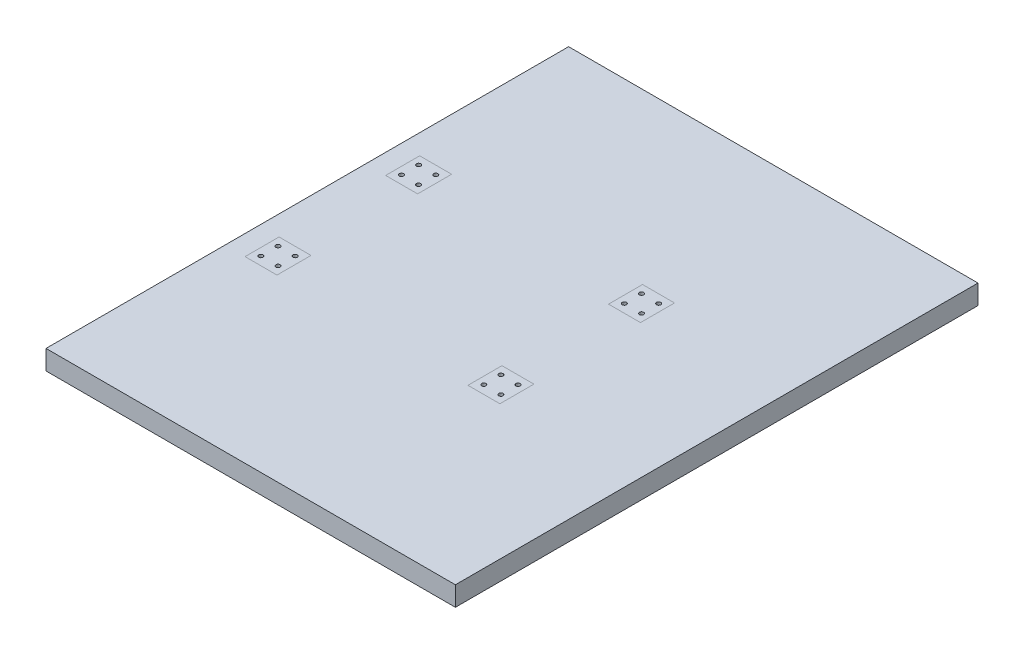
ISO-10303-21;
HEADER;
FILE_DESCRIPTION(('STEP AP214'),'2;1');
FILE_NAME('part.step','',(''),(''),'','','');
FILE_SCHEMA(('AUTOMOTIVE_DESIGN { 1 0 10303 214 1 1 1 1 }'));
ENDSEC;
DATA;
#1=APPLICATION_CONTEXT('core data for automotive mechanical design processes');
#2=APPLICATION_PROTOCOL_DEFINITION('international standard','automotive_design',2000,#1);
#3=PRODUCT_CONTEXT('',#1,'mechanical');
#4=PRODUCT('Part','Part','',(#3));
#5=PRODUCT_RELATED_PRODUCT_CATEGORY('part','',(#4));
#6=PRODUCT_DEFINITION_FORMATION('','',#4);
#7=PRODUCT_DEFINITION_CONTEXT('part definition',#1,'design');
#8=PRODUCT_DEFINITION('design','',#6,#7);
#9=PRODUCT_DEFINITION_SHAPE('','',#8);
#10=(LENGTH_UNIT() NAMED_UNIT(*) SI_UNIT(.MILLI.,.METRE.));
#11=(NAMED_UNIT(*) PLANE_ANGLE_UNIT() SI_UNIT($,.RADIAN.));
#12=(NAMED_UNIT(*) SI_UNIT($,.STERADIAN.) SOLID_ANGLE_UNIT());
#13=UNCERTAINTY_MEASURE_WITH_UNIT(LENGTH_MEASURE(1.E-05),#10,'distance_accuracy_value','');
#14=(GEOMETRIC_REPRESENTATION_CONTEXT(3) GLOBAL_UNCERTAINTY_ASSIGNED_CONTEXT((#13)) GLOBAL_UNIT_ASSIGNED_CONTEXT((#10,
#11,#12)) REPRESENTATION_CONTEXT('',''));
#15=CARTESIAN_POINT('',(0.,0.,0.));
#16=DIRECTION('',(0.,0.,1.));
#17=DIRECTION('',(1.,0.,0.));
#18=AXIS2_PLACEMENT_3D('',#15,#16,#17);
#19=CARTESIAN_POINT('',(0.,28.5,0.));
#20=DIRECTION('',(0.,1.,0.));
#21=DIRECTION('',(0.,0.,1.));
#22=AXIS2_PLACEMENT_3D('',#19,#20,#21);
#23=PLANE('',#22);
#24=DIRECTION('',(0.,0.,1.));
#25=VECTOR('',#24,1.);
#26=CARTESIAN_POINT('',(-196.099999999981,28.5,0.));
#27=LINE('',#26,#25);
#28=CARTESIAN_POINT('',(-196.099999999981,28.5,-147.300000000002));
#29=VERTEX_POINT('',#28);
#30=CARTESIAN_POINT('',(-196.099999999981,28.5,-97.7052668078004));
#31=VERTEX_POINT('',#30);
#32=EDGE_CURVE('E211',#29,#31,#27,.T.);
#33=ORIENTED_EDGE('',*,*,#32,.T.);
#34=DIRECTION('',(-1.,0.,0.));
#35=VECTOR('',#34,1.);
#36=CARTESIAN_POINT('',(0.,28.5,-97.7052668078004));
#37=LINE('',#36,#35);
#38=CARTESIAN_POINT('',(-242.699999999981,28.5,-97.7052668078004));
#39=VERTEX_POINT('',#38);
#40=EDGE_CURVE('E215',#31,#39,#37,.T.);
#41=ORIENTED_EDGE('',*,*,#40,.T.);
#42=DIRECTION('',(0.,0.,-1.));
#43=VECTOR('',#42,1.);
#44=CARTESIAN_POINT('',(-242.699999999981,28.5,0.));
#45=LINE('',#44,#43);
#46=CARTESIAN_POINT('',(-242.699999999981,28.5,-147.300000000002));
#47=VERTEX_POINT('',#46);
#48=EDGE_CURVE('E203',#39,#47,#45,.T.);
#49=ORIENTED_EDGE('',*,*,#48,.T.);
#50=DIRECTION('',(1.,0.,0.));
#51=VECTOR('',#50,1.);
#52=CARTESIAN_POINT('',(0.,28.5,-147.300000000002));
#53=LINE('',#52,#51);
#54=EDGE_CURVE('E207',#47,#29,#53,.T.);
#55=ORIENTED_EDGE('',*,*,#54,.T.);
#56=EDGE_LOOP('',(#33,#41,#49,#55));
#57=FACE_BOUND('',#56,.T.);
#58=DIRECTION('',(0.,0.,-1.));
#59=VECTOR('',#58,1.);
#60=CARTESIAN_POINT('',(-567.699999999979,28.5,1.39793265849579E-11));
#61=LINE('',#60,#59);
#62=CARTESIAN_POINT('',(-567.699999999976,28.5,107.300000000007));
#63=VERTEX_POINT('',#62);
#64=CARTESIAN_POINT('',(-567.699999999977,28.5,57.7052668078051));
#65=VERTEX_POINT('',#64);
#66=EDGE_CURVE('E181',#63,#65,#61,.T.);
#67=ORIENTED_EDGE('',*,*,#66,.T.);
#68=DIRECTION('',(1.,0.,0.));
#69=VECTOR('',#68,1.);
#70=CARTESIAN_POINT('',(1.40917078859337E-12,28.5,57.7052668077912));
#71=LINE('',#70,#69);
#72=CARTESIAN_POINT('',(-521.099999999977,28.5,57.705266807804));
#73=VERTEX_POINT('',#72);
#74=EDGE_CURVE('E185',#65,#73,#71,.T.);
#75=ORIENTED_EDGE('',*,*,#74,.T.);
#76=DIRECTION('',(0.,0.,1.));
#77=VECTOR('',#76,1.);
#78=CARTESIAN_POINT('',(-521.099999999979,28.5,1.28318250544681E-11));
#79=LINE('',#78,#77);
#80=CARTESIAN_POINT('',(-521.099999999976,28.5,107.300000000006));
#81=VERTEX_POINT('',#80);
#82=EDGE_CURVE('E173',#73,#81,#79,.T.);
#83=ORIENTED_EDGE('',*,*,#82,.T.);
#84=DIRECTION('',(-1.,0.,0.));
#85=VECTOR('',#84,1.);
#86=CARTESIAN_POINT('',(2.62028119754997E-12,28.5,107.299999999993));
#87=LINE('',#86,#85);
#88=EDGE_CURVE('E177',#81,#63,#87,.T.);
#89=ORIENTED_EDGE('',*,*,#88,.T.);
#90=EDGE_LOOP('',(#67,#75,#83,#89));
#91=FACE_BOUND('',#90,.T.);
#92=DIRECTION('',(0.,0.,1.));
#93=VECTOR('',#92,1.);
#94=CARTESIAN_POINT('',(0.,28.5,-393.7));
#95=LINE('',#94,#93);
#96=CARTESIAN_POINT('',(0.,28.5,-393.7));
#97=VERTEX_POINT('',#96);
#98=CARTESIAN_POINT('',(0.,28.5,368.3));
#99=VERTEX_POINT('',#98);
#100=EDGE_CURVE('E132',#97,#99,#95,.T.);
#101=ORIENTED_EDGE('',*,*,#100,.F.);
#102=DIRECTION('',(-1.,0.,0.));
#103=VECTOR('',#102,1.);
#104=CARTESIAN_POINT('',(-596.9,28.5,-393.7));
#105=LINE('',#104,#103);
#106=CARTESIAN_POINT('',(-596.9,28.5,-393.7));
#107=VERTEX_POINT('',#106);
#108=EDGE_CURVE('E161',#97,#107,#105,.T.);
#109=ORIENTED_EDGE('',*,*,#108,.T.);
#110=DIRECTION('',(0.,0.,1.));
#111=VECTOR('',#110,1.);
#112=CARTESIAN_POINT('',(-596.9,28.5,-393.7));
#113=LINE('',#112,#111);
#114=CARTESIAN_POINT('',(-596.9,28.5,368.3));
#115=VERTEX_POINT('',#114);
#116=EDGE_CURVE('E155',#107,#115,#113,.T.);
#117=ORIENTED_EDGE('',*,*,#116,.T.);
#118=DIRECTION('',(1.,0.,0.));
#119=VECTOR('',#118,1.);
#120=CARTESIAN_POINT('',(-596.9,28.5,368.3));
#121=LINE('',#120,#119);
#122=EDGE_CURVE('E149',#115,#99,#121,.T.);
#123=ORIENTED_EDGE('',*,*,#122,.T.);
#124=EDGE_LOOP('',(#101,#109,#117,#123));
#125=FACE_BOUND('',#124,.T.);
#126=DIRECTION('',(0.,0.,-1.));
#127=VECTOR('',#126,1.);
#128=CARTESIAN_POINT('',(-242.699999999978,28.5,5.97636526716419E-12));
#129=LINE('',#128,#127);
#130=CARTESIAN_POINT('',(-242.699999999975,28.5,107.299999999999));
#131=VERTEX_POINT('',#130);
#132=CARTESIAN_POINT('',(-242.699999999977,28.5,57.7052668077973));
#133=VERTEX_POINT('',#132);
#134=EDGE_CURVE('E196',#131,#133,#129,.T.);
#135=ORIENTED_EDGE('',*,*,#134,.T.);
#136=DIRECTION('',(1.,0.,0.));
#137=VECTOR('',#136,1.);
#138=CARTESIAN_POINT('',(1.40917078859338E-12,28.5,57.7052668077914));
#139=LINE('',#138,#137);
#140=CARTESIAN_POINT('',(-196.099999999977,28.5,57.7052668077962));
#141=VERTEX_POINT('',#140);
#142=EDGE_CURVE('E200',#133,#141,#139,.T.);
#143=ORIENTED_EDGE('',*,*,#142,.T.);
#144=DIRECTION('',(0.,0.,1.));
#145=VECTOR('',#144,1.);
#146=CARTESIAN_POINT('',(-196.099999999978,28.5,4.82886373667438E-12));
#147=LINE('',#146,#145);
#148=CARTESIAN_POINT('',(-196.099999999975,28.5,107.299999999998));
#149=VERTEX_POINT('',#148);
#150=EDGE_CURVE('E188',#141,#149,#147,.T.);
#151=ORIENTED_EDGE('',*,*,#150,.T.);
#152=DIRECTION('',(-1.,0.,0.));
#153=VECTOR('',#152,1.);
#154=CARTESIAN_POINT('',(2.62028119754998E-12,28.5,107.299999999993));
#155=LINE('',#154,#153);
#156=EDGE_CURVE('E192',#149,#131,#155,.T.);
#157=ORIENTED_EDGE('',*,*,#156,.T.);
#158=EDGE_LOOP('',(#135,#143,#151,#157));
#159=FACE_BOUND('',#158,.T.);
#160=DIRECTION('',(0.,0.,1.));
#161=VECTOR('',#160,1.);
#162=CARTESIAN_POINT('',(-521.099999999982,28.5,0.));
#163=LINE('',#162,#161);
#164=CARTESIAN_POINT('',(-521.099999999982,28.5,-147.299999999995));
#165=VERTEX_POINT('',#164);
#166=CARTESIAN_POINT('',(-521.099999999982,28.5,-97.7052668077925));
#167=VERTEX_POINT('',#166);
#168=EDGE_CURVE('E57',#165,#167,#163,.T.);
#169=ORIENTED_EDGE('',*,*,#168,.T.);
#170=DIRECTION('',(-1.,0.,0.));
#171=VECTOR('',#170,1.);
#172=CARTESIAN_POINT('',(0.,28.5,-97.7052668077925));
#173=LINE('',#172,#171);
#174=CARTESIAN_POINT('',(-567.699999999982,28.5,-97.7052668077925));
#175=VERTEX_POINT('',#174);
#176=EDGE_CURVE('E12',#167,#175,#173,.T.);
#177=ORIENTED_EDGE('',*,*,#176,.T.);
#178=DIRECTION('',(0.,0.,-1.));
#179=VECTOR('',#178,1.);
#180=CARTESIAN_POINT('',(-567.699999999982,28.5,0.));
#181=LINE('',#180,#179);
#182=CARTESIAN_POINT('',(-567.699999999982,28.5,-147.299999999995));
#183=VERTEX_POINT('',#182);
#184=EDGE_CURVE('E218',#175,#183,#181,.T.);
#185=ORIENTED_EDGE('',*,*,#184,.T.);
#186=DIRECTION('',(1.,0.,0.));
#187=VECTOR('',#186,1.);
#188=CARTESIAN_POINT('',(0.,28.5,-147.299999999995));
#189=LINE('',#188,#187);
#190=EDGE_CURVE('E222',#183,#165,#189,.T.);
#191=ORIENTED_EDGE('',*,*,#190,.T.);
#192=EDGE_LOOP('',(#169,#177,#185,#191));
#193=FACE_BOUND('',#192,.T.);
#194=ADVANCED_FACE('F48',(#57,#91,#125,#159,#193),#23,.T.);
#195=ORIENTED_EDGE('',*,*,#176,.F.);
#196=ORIENTED_EDGE('',*,*,#168,.F.);
#197=ORIENTED_EDGE('',*,*,#190,.F.);
#198=ORIENTED_EDGE('',*,*,#184,.F.);
#199=EDGE_LOOP('',(#195,#196,#197,#198));
#200=FACE_BOUND('',#199,.T.);
#201=CARTESIAN_POINT('',(-556.9,28.5,-135.));
#202=DIRECTION('',(0.,1.,0.));
#203=DIRECTION('',(0.,0.,1.));
#204=AXIS2_PLACEMENT_3D('',#201,#202,#203);
#205=CIRCLE('',#204,3.09999999999999);
#206=CARTESIAN_POINT('',(-556.9,28.5,-131.9));
#207=VERTEX_POINT('',#206);
#208=EDGE_CURVE('E236',#207,#207,#205,.T.);
#209=ORIENTED_EDGE('',*,*,#208,.F.);
#210=EDGE_LOOP('',(#209));
#211=FACE_BOUND('',#210,.T.);
#212=CARTESIAN_POINT('',(-531.9,28.5,-135.));
#213=DIRECTION('',(0.,1.,0.));
#214=DIRECTION('',(0.,0.,1.));
#215=AXIS2_PLACEMENT_3D('',#212,#213,#214);
#216=CIRCLE('',#215,3.09999999999999);
#217=CARTESIAN_POINT('',(-531.9,28.5,-131.9));
#218=VERTEX_POINT('',#217);
#219=EDGE_CURVE('E240',#218,#218,#216,.T.);
#220=ORIENTED_EDGE('',*,*,#219,.F.);
#221=EDGE_LOOP('',(#220));
#222=FACE_BOUND('',#221,.T.);
#223=CARTESIAN_POINT('',(-531.9,28.5,-110.));
#224=DIRECTION('',(0.,1.,0.));
#225=DIRECTION('',(0.,0.,1.));
#226=AXIS2_PLACEMENT_3D('',#223,#224,#225);
#227=CIRCLE('',#226,3.09999999999999);
#228=CARTESIAN_POINT('',(-531.9,28.5,-106.9));
#229=VERTEX_POINT('',#228);
#230=EDGE_CURVE('E244',#229,#229,#227,.T.);
#231=ORIENTED_EDGE('',*,*,#230,.F.);
#232=EDGE_LOOP('',(#231));
#233=FACE_BOUND('',#232,.T.);
#234=CARTESIAN_POINT('',(-556.9,28.5,-110.));
#235=DIRECTION('',(0.,1.,0.));
#236=DIRECTION('',(0.,0.,1.));
#237=AXIS2_PLACEMENT_3D('',#234,#235,#236);
#238=CIRCLE('',#237,3.09999999999999);
#239=CARTESIAN_POINT('',(-556.9,28.5,-106.9));
#240=VERTEX_POINT('',#239);
#241=EDGE_CURVE('E247',#240,#240,#238,.T.);
#242=ORIENTED_EDGE('',*,*,#241,.F.);
#243=EDGE_LOOP('',(#242));
#244=FACE_BOUND('',#243,.T.);
#245=ADVANCED_FACE('F228',(#200,#211,#222,#233,#244),#23,.T.);
#246=ORIENTED_EDGE('',*,*,#40,.F.);
#247=ORIENTED_EDGE('',*,*,#32,.F.);
#248=ORIENTED_EDGE('',*,*,#54,.F.);
#249=ORIENTED_EDGE('',*,*,#48,.F.);
#250=EDGE_LOOP('',(#246,#247,#248,#249));
#251=FACE_BOUND('',#250,.T.);
#252=CARTESIAN_POINT('',(-231.9,28.5,-110.));
#253=DIRECTION('',(0.,1.,0.));
#254=DIRECTION('',(0.,0.,1.));
#255=AXIS2_PLACEMENT_3D('',#252,#253,#254);
#256=CIRCLE('',#255,3.09999999999999);
#257=CARTESIAN_POINT('',(-231.9,28.5,-106.9));
#258=VERTEX_POINT('',#257);
#259=EDGE_CURVE('E259',#258,#258,#256,.T.);
#260=ORIENTED_EDGE('',*,*,#259,.F.);
#261=EDGE_LOOP('',(#260));
#262=FACE_BOUND('',#261,.T.);
#263=CARTESIAN_POINT('',(-206.9,28.5,-110.));
#264=DIRECTION('',(0.,1.,0.));
#265=DIRECTION('',(0.,0.,1.));
#266=AXIS2_PLACEMENT_3D('',#263,#264,#265);
#267=CIRCLE('',#266,3.09999999999999);
#268=CARTESIAN_POINT('',(-206.9,28.5,-106.9));
#269=VERTEX_POINT('',#268);
#270=EDGE_CURVE('E277',#269,#269,#267,.T.);
#271=ORIENTED_EDGE('',*,*,#270,.F.);
#272=EDGE_LOOP('',(#271));
#273=FACE_BOUND('',#272,.T.);
#274=CARTESIAN_POINT('',(-206.9,28.5,-135.));
#275=DIRECTION('',(0.,1.,0.));
#276=DIRECTION('',(0.,0.,1.));
#277=AXIS2_PLACEMENT_3D('',#274,#275,#276);
#278=CIRCLE('',#277,3.09999999999999);
#279=CARTESIAN_POINT('',(-206.9,28.5,-131.9));
#280=VERTEX_POINT('',#279);
#281=EDGE_CURVE('E282',#280,#280,#278,.T.);
#282=ORIENTED_EDGE('',*,*,#281,.F.);
#283=EDGE_LOOP('',(#282));
#284=FACE_BOUND('',#283,.T.);
#285=CARTESIAN_POINT('',(-231.9,28.5,-135.));
#286=DIRECTION('',(0.,1.,0.));
#287=DIRECTION('',(0.,0.,1.));
#288=AXIS2_PLACEMENT_3D('',#285,#286,#287);
#289=CIRCLE('',#288,3.09999999999999);
#290=CARTESIAN_POINT('',(-231.9,28.5,-131.9));
#291=VERTEX_POINT('',#290);
#292=EDGE_CURVE('E288',#291,#291,#289,.T.);
#293=ORIENTED_EDGE('',*,*,#292,.F.);
#294=EDGE_LOOP('',(#293));
#295=FACE_BOUND('',#294,.T.);
#296=ADVANCED_FACE('F231',(#251,#262,#273,#284,#295),#23,.T.);
#297=ORIENTED_EDGE('',*,*,#142,.F.);
#298=ORIENTED_EDGE('',*,*,#134,.F.);
#299=ORIENTED_EDGE('',*,*,#156,.F.);
#300=ORIENTED_EDGE('',*,*,#150,.F.);
#301=EDGE_LOOP('',(#297,#298,#299,#300));
#302=FACE_BOUND('',#301,.T.);
#303=CARTESIAN_POINT('',(-206.9,28.5,94.9999999999999));
#304=DIRECTION('',(0.,1.,0.));
#305=DIRECTION('',(0.,0.,-1.));
#306=AXIS2_PLACEMENT_3D('',#303,#304,#305);
#307=CIRCLE('',#306,3.09999999999999);
#308=CARTESIAN_POINT('',(-206.9,28.5,91.8999999999999));
#309=VERTEX_POINT('',#308);
#310=EDGE_CURVE('E306',#309,#309,#307,.T.);
#311=ORIENTED_EDGE('',*,*,#310,.F.);
#312=EDGE_LOOP('',(#311));
#313=FACE_BOUND('',#312,.T.);
#314=CARTESIAN_POINT('',(-231.9,28.5,94.9999999999999));
#315=DIRECTION('',(0.,1.,0.));
#316=DIRECTION('',(0.,0.,-1.));
#317=AXIS2_PLACEMENT_3D('',#314,#315,#316);
#318=CIRCLE('',#317,3.09999999999999);
#319=CARTESIAN_POINT('',(-231.9,28.5,91.8999999999999));
#320=VERTEX_POINT('',#319);
#321=EDGE_CURVE('E300',#320,#320,#318,.T.);
#322=ORIENTED_EDGE('',*,*,#321,.F.);
#323=EDGE_LOOP('',(#322));
#324=FACE_BOUND('',#323,.T.);
#325=CARTESIAN_POINT('',(-231.9,28.5,70.));
#326=DIRECTION('',(0.,1.,0.));
#327=DIRECTION('',(0.,0.,-1.));
#328=AXIS2_PLACEMENT_3D('',#325,#326,#327);
#329=CIRCLE('',#328,3.09999999999999);
#330=CARTESIAN_POINT('',(-231.9,28.5,66.9));
#331=VERTEX_POINT('',#330);
#332=EDGE_CURVE('E294',#331,#331,#329,.T.);
#333=ORIENTED_EDGE('',*,*,#332,.F.);
#334=EDGE_LOOP('',(#333));
#335=FACE_BOUND('',#334,.T.);
#336=CARTESIAN_POINT('',(-206.9,28.5,70.));
#337=DIRECTION('',(0.,1.,0.));
#338=DIRECTION('',(0.,0.,-1.));
#339=AXIS2_PLACEMENT_3D('',#336,#337,#338);
#340=CIRCLE('',#339,3.09999999999999);
#341=CARTESIAN_POINT('',(-206.9,28.5,66.9));
#342=VERTEX_POINT('',#341);
#343=EDGE_CURVE('E249',#342,#342,#340,.T.);
#344=ORIENTED_EDGE('',*,*,#343,.F.);
#345=EDGE_LOOP('',(#344));
#346=FACE_BOUND('',#345,.T.);
#347=ADVANCED_FACE('F361',(#302,#313,#324,#335,#346),#23,.T.);
#348=CARTESIAN_POINT('',(-596.9,28.5,-393.7));
#349=DIRECTION('',(0.,0.,1.));
#350=DIRECTION('',(1.,0.,0.));
#351=AXIS2_PLACEMENT_3D('',#348,#349,#350);
#352=PLANE('',#351);
#353=ORIENTED_EDGE('',*,*,#108,.F.);
#354=DIRECTION('',(0.,-1.,0.));
#355=VECTOR('',#354,1.);
#356=CARTESIAN_POINT('',(0.,0.,-393.7));
#357=LINE('',#356,#355);
#358=CARTESIAN_POINT('',(0.,0.,-393.7));
#359=VERTEX_POINT('',#358);
#360=EDGE_CURVE('E138',#97,#359,#357,.T.);
#361=ORIENTED_EDGE('',*,*,#360,.T.);
#362=DIRECTION('',(-1.,0.,0.));
#363=VECTOR('',#362,1.);
#364=CARTESIAN_POINT('',(-596.9,0.,-393.7));
#365=LINE('',#364,#363);
#366=CARTESIAN_POINT('',(-596.9,0.,-393.7));
#367=VERTEX_POINT('',#366);
#368=EDGE_CURVE('E165',#359,#367,#365,.T.);
#369=ORIENTED_EDGE('',*,*,#368,.T.);
#370=DIRECTION('',(0.,-1.,0.));
#371=VECTOR('',#370,1.);
#372=CARTESIAN_POINT('',(-596.9,28.5,-393.7));
#373=LINE('',#372,#371);
#374=EDGE_CURVE('E159',#107,#367,#373,.T.);
#375=ORIENTED_EDGE('',*,*,#374,.F.);
#376=EDGE_LOOP('',(#353,#361,#369,#375));
#377=FACE_BOUND('',#376,.T.);
#378=ADVANCED_FACE('F50',(#377),#352,.F.);
#379=CARTESIAN_POINT('',(-596.9,28.5,-393.7));
#380=DIRECTION('',(1.,0.,0.));
#381=DIRECTION('',(0.,0.,-1.));
#382=AXIS2_PLACEMENT_3D('',#379,#380,#381);
#383=PLANE('',#382);
#384=DIRECTION('',(0.,0.,1.));
#385=VECTOR('',#384,1.);
#386=CARTESIAN_POINT('',(-596.9,0.,-393.7));
#387=LINE('',#386,#385);
#388=CARTESIAN_POINT('',(-596.9,0.,368.3));
#389=VERTEX_POINT('',#388);
#390=EDGE_CURVE('E167',#367,#389,#387,.T.);
#391=ORIENTED_EDGE('',*,*,#390,.T.);
#392=DIRECTION('',(0.,-1.,0.));
#393=VECTOR('',#392,1.);
#394=CARTESIAN_POINT('',(-596.9,28.5,368.3));
#395=LINE('',#394,#393);
#396=EDGE_CURVE('E157',#115,#389,#395,.T.);
#397=ORIENTED_EDGE('',*,*,#396,.F.);
#398=ORIENTED_EDGE('',*,*,#116,.F.);
#399=ORIENTED_EDGE('',*,*,#374,.T.);
#400=EDGE_LOOP('',(#391,#397,#398,#399));
#401=FACE_BOUND('',#400,.T.);
#402=ADVANCED_FACE('F342',(#401),#383,.F.);
#403=CARTESIAN_POINT('',(-596.9,28.5,368.3));
#404=DIRECTION('',(0.,0.,-1.));
#405=DIRECTION('',(-1.,0.,0.));
#406=AXIS2_PLACEMENT_3D('',#403,#404,#405);
#407=PLANE('',#406);
#408=DIRECTION('',(1.,0.,0.));
#409=VECTOR('',#408,1.);
#410=CARTESIAN_POINT('',(-596.9,0.,368.3));
#411=LINE('',#410,#409);
#412=CARTESIAN_POINT('',(0.,0.,368.3));
#413=VERTEX_POINT('',#412);
#414=EDGE_CURVE('E151',#389,#413,#411,.T.);
#415=ORIENTED_EDGE('',*,*,#414,.T.);
#416=DIRECTION('',(0.,-1.,0.));
#417=VECTOR('',#416,1.);
#418=CARTESIAN_POINT('',(0.,0.,368.3));
#419=LINE('',#418,#417);
#420=EDGE_CURVE('E135',#99,#413,#419,.T.);
#421=ORIENTED_EDGE('',*,*,#420,.F.);
#422=ORIENTED_EDGE('',*,*,#122,.F.);
#423=ORIENTED_EDGE('',*,*,#396,.T.);
#424=EDGE_LOOP('',(#415,#421,#422,#423));
#425=FACE_BOUND('',#424,.T.);
#426=ADVANCED_FACE('F147',(#425),#407,.F.);
#427=ORIENTED_EDGE('',*,*,#74,.F.);
#428=ORIENTED_EDGE('',*,*,#66,.F.);
#429=ORIENTED_EDGE('',*,*,#88,.F.);
#430=ORIENTED_EDGE('',*,*,#82,.F.);
#431=EDGE_LOOP('',(#427,#428,#429,#430));
#432=FACE_BOUND('',#431,.T.);
#433=CARTESIAN_POINT('',(-531.9,28.5,70.));
#434=DIRECTION('',(0.,1.,0.));
#435=DIRECTION('',(0.,0.,-1.));
#436=AXIS2_PLACEMENT_3D('',#433,#434,#435);
#437=CIRCLE('',#436,3.09999999999999);
#438=CARTESIAN_POINT('',(-531.9,28.5,66.9));
#439=VERTEX_POINT('',#438);
#440=EDGE_CURVE('E312',#439,#439,#437,.T.);
#441=ORIENTED_EDGE('',*,*,#440,.F.);
#442=EDGE_LOOP('',(#441));
#443=FACE_BOUND('',#442,.T.);
#444=CARTESIAN_POINT('',(-531.9,28.5,94.9999999999999));
#445=DIRECTION('',(0.,1.,0.));
#446=DIRECTION('',(0.,0.,-1.));
#447=AXIS2_PLACEMENT_3D('',#444,#445,#446);
#448=CIRCLE('',#447,3.09999999999999);
#449=CARTESIAN_POINT('',(-531.9,28.5,91.8999999999999));
#450=VERTEX_POINT('',#449);
#451=EDGE_CURVE('E318',#450,#450,#448,.T.);
#452=ORIENTED_EDGE('',*,*,#451,.F.);
#453=EDGE_LOOP('',(#452));
#454=FACE_BOUND('',#453,.T.);
#455=CARTESIAN_POINT('',(-556.9,28.5,70.));
#456=DIRECTION('',(0.,1.,0.));
#457=DIRECTION('',(0.,0.,-1.));
#458=AXIS2_PLACEMENT_3D('',#455,#456,#457);
#459=CIRCLE('',#458,3.09999999999999);
#460=CARTESIAN_POINT('',(-556.9,28.5,66.9));
#461=VERTEX_POINT('',#460);
#462=EDGE_CURVE('E324',#461,#461,#459,.T.);
#463=ORIENTED_EDGE('',*,*,#462,.F.);
#464=EDGE_LOOP('',(#463));
#465=FACE_BOUND('',#464,.T.);
#466=CARTESIAN_POINT('',(-556.9,28.5,94.9999999999999));
#467=DIRECTION('',(0.,1.,0.));
#468=DIRECTION('',(0.,0.,-1.));
#469=AXIS2_PLACEMENT_3D('',#466,#467,#468);
#470=CIRCLE('',#469,3.09999999999999);
#471=CARTESIAN_POINT('',(-556.9,28.5,91.8999999999999));
#472=VERTEX_POINT('',#471);
#473=EDGE_CURVE('E330',#472,#472,#470,.T.);
#474=ORIENTED_EDGE('',*,*,#473,.F.);
#475=EDGE_LOOP('',(#474));
#476=FACE_BOUND('',#475,.T.);
#477=ADVANCED_FACE('F348',(#432,#443,#454,#465,#476),#23,.T.);
#478=CARTESIAN_POINT('',(0.,0.,0.));
#479=DIRECTION('',(0.,1.,0.));
#480=DIRECTION('',(0.,0.,1.));
#481=AXIS2_PLACEMENT_3D('',#478,#479,#480);
#482=PLANE('',#481);
#483=CARTESIAN_POINT('',(-556.9,0.,-110.));
#484=DIRECTION('',(0.,1.,0.));
#485=DIRECTION('',(0.,0.,1.));
#486=AXIS2_PLACEMENT_3D('',#483,#484,#485);
#487=CIRCLE('',#486,3.09999999999999);
#488=CARTESIAN_POINT('',(-556.9,0.,-106.9));
#489=VERTEX_POINT('',#488);
#490=EDGE_CURVE('E168',#489,#489,#487,.F.);
#491=ORIENTED_EDGE('',*,*,#490,.F.);
#492=EDGE_LOOP('',(#491));
#493=FACE_BOUND('',#492,.T.);
#494=CARTESIAN_POINT('',(-206.9,0.,70.));
#495=DIRECTION('',(0.,1.,0.));
#496=DIRECTION('',(0.,0.,1.));
#497=AXIS2_PLACEMENT_3D('',#494,#495,#496);
#498=CIRCLE('',#497,3.09999999999999);
#499=CARTESIAN_POINT('',(-206.9,0.,73.0999999999999));
#500=VERTEX_POINT('',#499);
#501=EDGE_CURVE('E254',#500,#500,#498,.F.);
#502=ORIENTED_EDGE('',*,*,#501,.F.);
#503=EDGE_LOOP('',(#502));
#504=FACE_BOUND('',#503,.T.);
#505=CARTESIAN_POINT('',(-231.9,0.,-110.));
#506=DIRECTION('',(0.,1.,0.));
#507=DIRECTION('',(0.,0.,1.));
#508=AXIS2_PLACEMENT_3D('',#505,#506,#507);
#509=CIRCLE('',#508,3.09999999999999);
#510=CARTESIAN_POINT('',(-231.9,0.,-106.9));
#511=VERTEX_POINT('',#510);
#512=EDGE_CURVE('E261',#511,#511,#509,.F.);
#513=ORIENTED_EDGE('',*,*,#512,.F.);
#514=EDGE_LOOP('',(#513));
#515=FACE_BOUND('',#514,.T.);
#516=CARTESIAN_POINT('',(-531.9,0.,-110.));
#517=DIRECTION('',(0.,1.,0.));
#518=DIRECTION('',(0.,0.,1.));
#519=AXIS2_PLACEMENT_3D('',#516,#517,#518);
#520=CIRCLE('',#519,3.09999999999999);
#521=CARTESIAN_POINT('',(-531.9,0.,-106.9));
#522=VERTEX_POINT('',#521);
#523=EDGE_CURVE('E266',#522,#522,#520,.F.);
#524=ORIENTED_EDGE('',*,*,#523,.F.);
#525=EDGE_LOOP('',(#524));
#526=FACE_BOUND('',#525,.T.);
#527=CARTESIAN_POINT('',(-531.9,0.,-135.));
#528=DIRECTION('',(0.,1.,0.));
#529=DIRECTION('',(0.,0.,1.));
#530=AXIS2_PLACEMENT_3D('',#527,#528,#529);
#531=CIRCLE('',#530,3.09999999999999);
#532=CARTESIAN_POINT('',(-531.9,0.,-131.9));
#533=VERTEX_POINT('',#532);
#534=EDGE_CURVE('E270',#533,#533,#531,.F.);
#535=ORIENTED_EDGE('',*,*,#534,.F.);
#536=EDGE_LOOP('',(#535));
#537=FACE_BOUND('',#536,.T.);
#538=CARTESIAN_POINT('',(-556.9,0.,-135.));
#539=DIRECTION('',(0.,1.,0.));
#540=DIRECTION('',(0.,0.,1.));
#541=AXIS2_PLACEMENT_3D('',#538,#539,#540);
#542=CIRCLE('',#541,3.09999999999999);
#543=CARTESIAN_POINT('',(-556.9,0.,-131.9));
#544=VERTEX_POINT('',#543);
#545=EDGE_CURVE('E274',#544,#544,#542,.F.);
#546=ORIENTED_EDGE('',*,*,#545,.F.);
#547=EDGE_LOOP('',(#546));
#548=FACE_BOUND('',#547,.T.);
#549=CARTESIAN_POINT('',(-206.9,0.,-110.));
#550=DIRECTION('',(0.,1.,0.));
#551=DIRECTION('',(0.,0.,1.));
#552=AXIS2_PLACEMENT_3D('',#549,#550,#551);
#553=CIRCLE('',#552,3.09999999999999);
#554=CARTESIAN_POINT('',(-206.9,0.,-106.9));
#555=VERTEX_POINT('',#554);
#556=EDGE_CURVE('E279',#555,#555,#553,.F.);
#557=ORIENTED_EDGE('',*,*,#556,.F.);
#558=EDGE_LOOP('',(#557));
#559=FACE_BOUND('',#558,.T.);
#560=CARTESIAN_POINT('',(-206.9,0.,-135.));
#561=DIRECTION('',(0.,1.,0.));
#562=DIRECTION('',(0.,0.,1.));
#563=AXIS2_PLACEMENT_3D('',#560,#561,#562);
#564=CIRCLE('',#563,3.09999999999999);
#565=CARTESIAN_POINT('',(-206.9,0.,-131.9));
#566=VERTEX_POINT('',#565);
#567=EDGE_CURVE('E285',#566,#566,#564,.F.);
#568=ORIENTED_EDGE('',*,*,#567,.F.);
#569=EDGE_LOOP('',(#568));
#570=FACE_BOUND('',#569,.T.);
#571=CARTESIAN_POINT('',(-231.9,0.,-135.));
#572=DIRECTION('',(0.,1.,0.));
#573=DIRECTION('',(0.,0.,1.));
#574=AXIS2_PLACEMENT_3D('',#571,#572,#573);
#575=CIRCLE('',#574,3.09999999999999);
#576=CARTESIAN_POINT('',(-231.9,0.,-131.9));
#577=VERTEX_POINT('',#576);
#578=EDGE_CURVE('E291',#577,#577,#575,.F.);
#579=ORIENTED_EDGE('',*,*,#578,.F.);
#580=EDGE_LOOP('',(#579));
#581=FACE_BOUND('',#580,.T.);
#582=CARTESIAN_POINT('',(-231.9,0.,70.));
#583=DIRECTION('',(0.,1.,0.));
#584=DIRECTION('',(0.,0.,1.));
#585=AXIS2_PLACEMENT_3D('',#582,#583,#584);
#586=CIRCLE('',#585,3.09999999999999);
#587=CARTESIAN_POINT('',(-231.9,0.,73.0999999999999));
#588=VERTEX_POINT('',#587);
#589=EDGE_CURVE('E297',#588,#588,#586,.F.);
#590=ORIENTED_EDGE('',*,*,#589,.F.);
#591=EDGE_LOOP('',(#590));
#592=FACE_BOUND('',#591,.T.);
#593=CARTESIAN_POINT('',(-231.9,0.,94.9999999999999));
#594=DIRECTION('',(0.,1.,0.));
#595=DIRECTION('',(0.,0.,1.));
#596=AXIS2_PLACEMENT_3D('',#593,#594,#595);
#597=CIRCLE('',#596,3.09999999999999);
#598=CARTESIAN_POINT('',(-231.9,0.,98.0999999999999));
#599=VERTEX_POINT('',#598);
#600=EDGE_CURVE('E303',#599,#599,#597,.F.);
#601=ORIENTED_EDGE('',*,*,#600,.F.);
#602=EDGE_LOOP('',(#601));
#603=FACE_BOUND('',#602,.T.);
#604=CARTESIAN_POINT('',(-206.9,0.,94.9999999999999));
#605=DIRECTION('',(0.,1.,0.));
#606=DIRECTION('',(0.,0.,1.));
#607=AXIS2_PLACEMENT_3D('',#604,#605,#606);
#608=CIRCLE('',#607,3.09999999999999);
#609=CARTESIAN_POINT('',(-206.9,0.,98.0999999999999));
#610=VERTEX_POINT('',#609);
#611=EDGE_CURVE('E309',#610,#610,#608,.F.);
#612=ORIENTED_EDGE('',*,*,#611,.F.);
#613=EDGE_LOOP('',(#612));
#614=FACE_BOUND('',#613,.T.);
#615=CARTESIAN_POINT('',(-531.9,0.,70.));
#616=DIRECTION('',(0.,1.,0.));
#617=DIRECTION('',(0.,0.,1.));
#618=AXIS2_PLACEMENT_3D('',#615,#616,#617);
#619=CIRCLE('',#618,3.09999999999999);
#620=CARTESIAN_POINT('',(-531.9,0.,73.0999999999999));
#621=VERTEX_POINT('',#620);
#622=EDGE_CURVE('E315',#621,#621,#619,.F.);
#623=ORIENTED_EDGE('',*,*,#622,.F.);
#624=EDGE_LOOP('',(#623));
#625=FACE_BOUND('',#624,.T.);
#626=CARTESIAN_POINT('',(-531.9,0.,94.9999999999999));
#627=DIRECTION('',(0.,1.,0.));
#628=DIRECTION('',(0.,0.,1.));
#629=AXIS2_PLACEMENT_3D('',#626,#627,#628);
#630=CIRCLE('',#629,3.09999999999999);
#631=CARTESIAN_POINT('',(-531.9,0.,98.0999999999999));
#632=VERTEX_POINT('',#631);
#633=EDGE_CURVE('E321',#632,#632,#630,.F.);
#634=ORIENTED_EDGE('',*,*,#633,.F.);
#635=EDGE_LOOP('',(#634));
#636=FACE_BOUND('',#635,.T.);
#637=CARTESIAN_POINT('',(-556.9,0.,70.));
#638=DIRECTION('',(0.,1.,0.));
#639=DIRECTION('',(0.,0.,1.));
#640=AXIS2_PLACEMENT_3D('',#637,#638,#639);
#641=CIRCLE('',#640,3.09999999999999);
#642=CARTESIAN_POINT('',(-556.9,0.,73.0999999999999));
#643=VERTEX_POINT('',#642);
#644=EDGE_CURVE('E327',#643,#643,#641,.F.);
#645=ORIENTED_EDGE('',*,*,#644,.F.);
#646=EDGE_LOOP('',(#645));
#647=FACE_BOUND('',#646,.T.);
#648=CARTESIAN_POINT('',(-556.9,0.,94.9999999999999));
#649=DIRECTION('',(0.,1.,0.));
#650=DIRECTION('',(0.,0.,1.));
#651=AXIS2_PLACEMENT_3D('',#648,#649,#650);
#652=CIRCLE('',#651,3.09999999999999);
#653=CARTESIAN_POINT('',(-556.9,0.,98.0999999999999));
#654=VERTEX_POINT('',#653);
#655=EDGE_CURVE('E333',#654,#654,#652,.F.);
#656=ORIENTED_EDGE('',*,*,#655,.F.);
#657=EDGE_LOOP('',(#656));
#658=FACE_BOUND('',#657,.T.);
#659=ORIENTED_EDGE('',*,*,#368,.F.);
#660=DIRECTION('',(0.,0.,1.));
#661=VECTOR('',#660,1.);
#662=CARTESIAN_POINT('',(0.,0.,-393.7));
#663=LINE('',#662,#661);
#664=EDGE_CURVE('E142',#359,#413,#663,.T.);
#665=ORIENTED_EDGE('',*,*,#664,.T.);
#666=ORIENTED_EDGE('',*,*,#414,.F.);
#667=ORIENTED_EDGE('',*,*,#390,.F.);
#668=EDGE_LOOP('',(#659,#665,#666,#667));
#669=FACE_BOUND('',#668,.T.);
#670=ADVANCED_FACE('F344',(#493,#504,#515,#526,#537,#548,#559,#570,#581,#592,#603,#614,#625,
#636,#647,#658,#669),#482,.F.);
#671=CARTESIAN_POINT('',(-556.9,-8.76812408671317,94.9999999999999));
#672=DIRECTION('',(0.,1.,0.));
#673=DIRECTION('',(0.,0.,1.));
#674=AXIS2_PLACEMENT_3D('',#671,#672,#673);
#675=CYLINDRICAL_SURFACE('',#674,3.09999999999999);
#676=ORIENTED_EDGE('',*,*,#655,.T.);
#677=EDGE_LOOP('',(#676));
#678=FACE_BOUND('',#677,.T.);
#679=ORIENTED_EDGE('',*,*,#473,.T.);
#680=EDGE_LOOP('',(#679));
#681=FACE_BOUND('',#680,.T.);
#682=ADVANCED_FACE('F347',(#678,#681),#675,.F.);
#683=CARTESIAN_POINT('',(-556.9,-8.76812408671317,70.));
#684=DIRECTION('',(0.,1.,0.));
#685=DIRECTION('',(0.,0.,1.));
#686=AXIS2_PLACEMENT_3D('',#683,#684,#685);
#687=CYLINDRICAL_SURFACE('',#686,3.09999999999999);
#688=ORIENTED_EDGE('',*,*,#644,.T.);
#689=EDGE_LOOP('',(#688));
#690=FACE_BOUND('',#689,.T.);
#691=ORIENTED_EDGE('',*,*,#462,.T.);
#692=EDGE_LOOP('',(#691));
#693=FACE_BOUND('',#692,.T.);
#694=ADVANCED_FACE('F356',(#690,#693),#687,.F.);
#695=CARTESIAN_POINT('',(-531.9,-8.76812408671317,94.9999999999999));
#696=DIRECTION('',(0.,1.,0.));
#697=DIRECTION('',(0.,0.,1.));
#698=AXIS2_PLACEMENT_3D('',#695,#696,#697);
#699=CYLINDRICAL_SURFACE('',#698,3.09999999999999);
#700=ORIENTED_EDGE('',*,*,#633,.T.);
#701=EDGE_LOOP('',(#700));
#702=FACE_BOUND('',#701,.T.);
#703=ORIENTED_EDGE('',*,*,#451,.T.);
#704=EDGE_LOOP('',(#703));
#705=FACE_BOUND('',#704,.T.);
#706=ADVANCED_FACE('F373',(#702,#705),#699,.F.);
#707=CARTESIAN_POINT('',(-531.9,-8.76812408671317,70.));
#708=DIRECTION('',(0.,1.,0.));
#709=DIRECTION('',(0.,0.,1.));
#710=AXIS2_PLACEMENT_3D('',#707,#708,#709);
#711=CYLINDRICAL_SURFACE('',#710,3.09999999999999);
#712=ORIENTED_EDGE('',*,*,#622,.T.);
#713=EDGE_LOOP('',(#712));
#714=FACE_BOUND('',#713,.T.);
#715=ORIENTED_EDGE('',*,*,#440,.T.);
#716=EDGE_LOOP('',(#715));
#717=FACE_BOUND('',#716,.T.);
#718=ADVANCED_FACE('F377',(#714,#717),#711,.F.);
#719=CARTESIAN_POINT('',(-206.9,-8.76812408671317,94.9999999999999));
#720=DIRECTION('',(0.,1.,0.));
#721=DIRECTION('',(0.,0.,1.));
#722=AXIS2_PLACEMENT_3D('',#719,#720,#721);
#723=CYLINDRICAL_SURFACE('',#722,3.09999999999999);
#724=ORIENTED_EDGE('',*,*,#611,.T.);
#725=EDGE_LOOP('',(#724));
#726=FACE_BOUND('',#725,.T.);
#727=ORIENTED_EDGE('',*,*,#310,.T.);
#728=EDGE_LOOP('',(#727));
#729=FACE_BOUND('',#728,.T.);
#730=ADVANCED_FACE('F381',(#726,#729),#723,.F.);
#731=CARTESIAN_POINT('',(-231.9,-8.76812408671317,94.9999999999999));
#732=DIRECTION('',(0.,1.,0.));
#733=DIRECTION('',(0.,0.,1.));
#734=AXIS2_PLACEMENT_3D('',#731,#732,#733);
#735=CYLINDRICAL_SURFACE('',#734,3.09999999999999);
#736=ORIENTED_EDGE('',*,*,#600,.T.);
#737=EDGE_LOOP('',(#736));
#738=FACE_BOUND('',#737,.T.);
#739=ORIENTED_EDGE('',*,*,#321,.T.);
#740=EDGE_LOOP('',(#739));
#741=FACE_BOUND('',#740,.T.);
#742=ADVANCED_FACE('F385',(#738,#741),#735,.F.);
#743=CARTESIAN_POINT('',(-231.9,-8.76812408671317,70.));
#744=DIRECTION('',(0.,1.,0.));
#745=DIRECTION('',(0.,0.,1.));
#746=AXIS2_PLACEMENT_3D('',#743,#744,#745);
#747=CYLINDRICAL_SURFACE('',#746,3.09999999999999);
#748=ORIENTED_EDGE('',*,*,#589,.T.);
#749=EDGE_LOOP('',(#748));
#750=FACE_BOUND('',#749,.T.);
#751=ORIENTED_EDGE('',*,*,#332,.T.);
#752=EDGE_LOOP('',(#751));
#753=FACE_BOUND('',#752,.T.);
#754=ADVANCED_FACE('F389',(#750,#753),#747,.F.);
#755=CARTESIAN_POINT('',(-231.9,-8.76812408671317,-135.));
#756=DIRECTION('',(0.,1.,0.));
#757=DIRECTION('',(0.,0.,1.));
#758=AXIS2_PLACEMENT_3D('',#755,#756,#757);
#759=CYLINDRICAL_SURFACE('',#758,3.09999999999999);
#760=ORIENTED_EDGE('',*,*,#578,.T.);
#761=EDGE_LOOP('',(#760));
#762=FACE_BOUND('',#761,.T.);
#763=ORIENTED_EDGE('',*,*,#292,.T.);
#764=EDGE_LOOP('',(#763));
#765=FACE_BOUND('',#764,.T.);
#766=ADVANCED_FACE('F393',(#762,#765),#759,.F.);
#767=CARTESIAN_POINT('',(-206.9,-8.76812408671317,-135.));
#768=DIRECTION('',(0.,1.,0.));
#769=DIRECTION('',(0.,0.,1.));
#770=AXIS2_PLACEMENT_3D('',#767,#768,#769);
#771=CYLINDRICAL_SURFACE('',#770,3.09999999999999);
#772=ORIENTED_EDGE('',*,*,#567,.T.);
#773=EDGE_LOOP('',(#772));
#774=FACE_BOUND('',#773,.T.);
#775=ORIENTED_EDGE('',*,*,#281,.T.);
#776=EDGE_LOOP('',(#775));
#777=FACE_BOUND('',#776,.T.);
#778=ADVANCED_FACE('F397',(#774,#777),#771,.F.);
#779=CARTESIAN_POINT('',(-206.9,-8.76812408671317,-110.));
#780=DIRECTION('',(0.,1.,0.));
#781=DIRECTION('',(0.,0.,1.));
#782=AXIS2_PLACEMENT_3D('',#779,#780,#781);
#783=CYLINDRICAL_SURFACE('',#782,3.09999999999999);
#784=ORIENTED_EDGE('',*,*,#556,.T.);
#785=EDGE_LOOP('',(#784));
#786=FACE_BOUND('',#785,.T.);
#787=ORIENTED_EDGE('',*,*,#270,.T.);
#788=EDGE_LOOP('',(#787));
#789=FACE_BOUND('',#788,.T.);
#790=ADVANCED_FACE('F401',(#786,#789),#783,.F.);
#791=CARTESIAN_POINT('',(-556.9,-8.76812408671317,-135.));
#792=DIRECTION('',(0.,1.,0.));
#793=DIRECTION('',(0.,0.,1.));
#794=AXIS2_PLACEMENT_3D('',#791,#792,#793);
#795=CYLINDRICAL_SURFACE('',#794,3.09999999999999);
#796=ORIENTED_EDGE('',*,*,#545,.T.);
#797=EDGE_LOOP('',(#796));
#798=FACE_BOUND('',#797,.T.);
#799=ORIENTED_EDGE('',*,*,#208,.T.);
#800=EDGE_LOOP('',(#799));
#801=FACE_BOUND('',#800,.T.);
#802=ADVANCED_FACE('F405',(#798,#801),#795,.F.);
#803=CARTESIAN_POINT('',(-531.9,-8.76812408671317,-135.));
#804=DIRECTION('',(0.,1.,0.));
#805=DIRECTION('',(0.,0.,1.));
#806=AXIS2_PLACEMENT_3D('',#803,#804,#805);
#807=CYLINDRICAL_SURFACE('',#806,3.09999999999999);
#808=ORIENTED_EDGE('',*,*,#534,.T.);
#809=EDGE_LOOP('',(#808));
#810=FACE_BOUND('',#809,.T.);
#811=ORIENTED_EDGE('',*,*,#219,.T.);
#812=EDGE_LOOP('',(#811));
#813=FACE_BOUND('',#812,.T.);
#814=ADVANCED_FACE('F409',(#810,#813),#807,.F.);
#815=CARTESIAN_POINT('',(-531.9,-8.76812408671317,-110.));
#816=DIRECTION('',(0.,1.,0.));
#817=DIRECTION('',(0.,0.,1.));
#818=AXIS2_PLACEMENT_3D('',#815,#816,#817);
#819=CYLINDRICAL_SURFACE('',#818,3.09999999999999);
#820=ORIENTED_EDGE('',*,*,#523,.T.);
#821=EDGE_LOOP('',(#820));
#822=FACE_BOUND('',#821,.T.);
#823=ORIENTED_EDGE('',*,*,#230,.T.);
#824=EDGE_LOOP('',(#823));
#825=FACE_BOUND('',#824,.T.);
#826=ADVANCED_FACE('F413',(#822,#825),#819,.F.);
#827=CARTESIAN_POINT('',(-231.9,-8.76812408671317,-110.));
#828=DIRECTION('',(0.,1.,0.));
#829=DIRECTION('',(0.,0.,1.));
#830=AXIS2_PLACEMENT_3D('',#827,#828,#829);
#831=CYLINDRICAL_SURFACE('',#830,3.09999999999999);
#832=ORIENTED_EDGE('',*,*,#512,.T.);
#833=EDGE_LOOP('',(#832));
#834=FACE_BOUND('',#833,.T.);
#835=ORIENTED_EDGE('',*,*,#259,.T.);
#836=EDGE_LOOP('',(#835));
#837=FACE_BOUND('',#836,.T.);
#838=ADVANCED_FACE('F417',(#834,#837),#831,.F.);
#839=CARTESIAN_POINT('',(-206.9,-8.76812408671317,70.));
#840=DIRECTION('',(0.,1.,0.));
#841=DIRECTION('',(0.,0.,1.));
#842=AXIS2_PLACEMENT_3D('',#839,#840,#841);
#843=CYLINDRICAL_SURFACE('',#842,3.09999999999999);
#844=ORIENTED_EDGE('',*,*,#501,.T.);
#845=EDGE_LOOP('',(#844));
#846=FACE_BOUND('',#845,.T.);
#847=ORIENTED_EDGE('',*,*,#343,.T.);
#848=EDGE_LOOP('',(#847));
#849=FACE_BOUND('',#848,.T.);
#850=ADVANCED_FACE('F421',(#846,#849),#843,.F.);
#851=CARTESIAN_POINT('',(-556.9,-8.76812408671317,-110.));
#852=DIRECTION('',(0.,1.,0.));
#853=DIRECTION('',(0.,0.,1.));
#854=AXIS2_PLACEMENT_3D('',#851,#852,#853);
#855=CYLINDRICAL_SURFACE('',#854,3.09999999999999);
#856=ORIENTED_EDGE('',*,*,#490,.T.);
#857=EDGE_LOOP('',(#856));
#858=FACE_BOUND('',#857,.T.);
#859=ORIENTED_EDGE('',*,*,#241,.T.);
#860=EDGE_LOOP('',(#859));
#861=FACE_BOUND('',#860,.T.);
#862=ADVANCED_FACE('F425',(#858,#861),#855,.F.);
#863=CARTESIAN_POINT('',(0.,0.,-393.7));
#864=DIRECTION('',(-1.,0.,0.));
#865=DIRECTION('',(0.,0.,1.));
#866=AXIS2_PLACEMENT_3D('',#863,#864,#865);
#867=PLANE('',#866);
#868=ORIENTED_EDGE('',*,*,#664,.F.);
#869=ORIENTED_EDGE('',*,*,#360,.F.);
#870=ORIENTED_EDGE('',*,*,#100,.T.);
#871=ORIENTED_EDGE('',*,*,#420,.T.);
#872=EDGE_LOOP('',(#868,#869,#870,#871));
#873=FACE_BOUND('',#872,.T.);
#874=ADVANCED_FACE('F134',(#873),#867,.F.);
#875=CLOSED_SHELL('',(#194,#245,#296,#347,#378,#402,#426,#477,#670,#682,#694,#706,#718,#730,
#742,#754,#766,#778,#790,#802,#814,#826,#838,#850,#862,#874));
#876=MANIFOLD_SOLID_BREP('B2',#875);
#877=ADVANCED_BREP_SHAPE_REPRESENTATION('',(#18,#876),#14);
#878=SHAPE_DEFINITION_REPRESENTATION(#9,#877);
ENDSEC;
END-ISO-10303-21;
